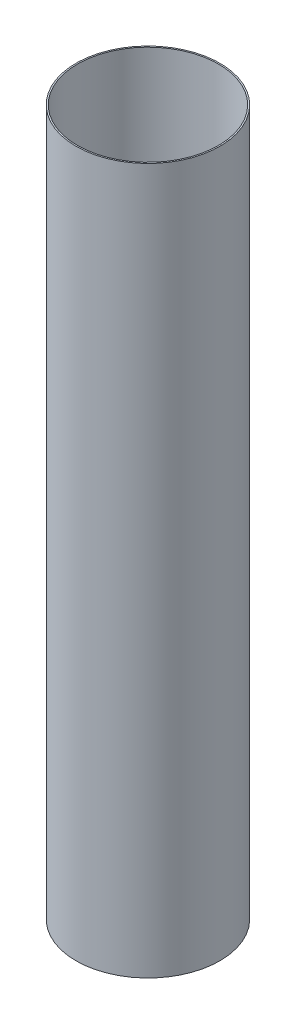
ISO-10303-21;
HEADER;
FILE_DESCRIPTION(('STEP AP214'),'2;1');
FILE_NAME('part.step','',(''),(''),'','','');
FILE_SCHEMA(('AUTOMOTIVE_DESIGN { 1 0 10303 214 1 1 1 1 }'));
ENDSEC;
DATA;
#1=APPLICATION_CONTEXT('core data for automotive mechanical design processes');
#2=APPLICATION_PROTOCOL_DEFINITION('international standard','automotive_design',2000,#1);
#3=PRODUCT_CONTEXT('',#1,'mechanical');
#4=PRODUCT('Part','Part','',(#3));
#5=PRODUCT_RELATED_PRODUCT_CATEGORY('part','',(#4));
#6=PRODUCT_DEFINITION_FORMATION('','',#4);
#7=PRODUCT_DEFINITION_CONTEXT('part definition',#1,'design');
#8=PRODUCT_DEFINITION('design','',#6,#7);
#9=PRODUCT_DEFINITION_SHAPE('','',#8);
#10=(LENGTH_UNIT() NAMED_UNIT(*) SI_UNIT(.MILLI.,.METRE.));
#11=(NAMED_UNIT(*) PLANE_ANGLE_UNIT() SI_UNIT($,.RADIAN.));
#12=(NAMED_UNIT(*) SI_UNIT($,.STERADIAN.) SOLID_ANGLE_UNIT());
#13=UNCERTAINTY_MEASURE_WITH_UNIT(LENGTH_MEASURE(1.E-05),#10,'distance_accuracy_value','');
#14=(GEOMETRIC_REPRESENTATION_CONTEXT(3) GLOBAL_UNCERTAINTY_ASSIGNED_CONTEXT((#13)) GLOBAL_UNIT_ASSIGNED_CONTEXT((#10,
#11,#12)) REPRESENTATION_CONTEXT('',''));
#15=CARTESIAN_POINT('',(0.,0.,0.));
#16=DIRECTION('',(0.,0.,1.));
#17=DIRECTION('',(1.,0.,0.));
#18=AXIS2_PLACEMENT_3D('',#15,#16,#17);
#19=CARTESIAN_POINT('',(0.,1500.,0.));
#20=DIRECTION('',(0.,1.,0.));
#21=DIRECTION('',(0.,0.,1.));
#22=AXIS2_PLACEMENT_3D('',#19,#20,#21);
#23=PLANE('',#22);
#24=CARTESIAN_POINT('',(0.,1500.,0.));
#25=DIRECTION('',(0.,1.,0.));
#26=DIRECTION('',(0.,0.,1.));
#27=AXIS2_PLACEMENT_3D('',#24,#25,#26);
#28=CIRCLE('',#27,153.);
#29=CARTESIAN_POINT('',(0.,1500.,153.));
#30=VERTEX_POINT('',#29);
#31=EDGE_CURVE('E10',#30,#30,#28,.T.);
#32=ORIENTED_EDGE('',*,*,#31,.T.);
#33=EDGE_LOOP('',(#32));
#34=FACE_BOUND('',#33,.T.);
#35=CARTESIAN_POINT('',(0.,1500.,0.));
#36=DIRECTION('',(0.,1.,0.));
#37=DIRECTION('',(0.,0.,1.));
#38=AXIS2_PLACEMENT_3D('',#35,#36,#37);
#39=CIRCLE('',#38,150.);
#40=CARTESIAN_POINT('',(0.,1500.,150.));
#41=VERTEX_POINT('',#40);
#42=EDGE_CURVE('E42',#41,#41,#39,.T.);
#43=ORIENTED_EDGE('',*,*,#42,.F.);
#44=EDGE_LOOP('',(#43));
#45=FACE_BOUND('',#44,.T.);
#46=ADVANCED_FACE('F31',(#34,#45),#23,.T.);
#47=CARTESIAN_POINT('',(0.,0.,0.));
#48=DIRECTION('',(0.,1.,0.));
#49=DIRECTION('',(0.,0.,1.));
#50=AXIS2_PLACEMENT_3D('',#47,#48,#49);
#51=PLANE('',#50);
#52=CARTESIAN_POINT('',(0.,0.,0.));
#53=DIRECTION('',(0.,1.,0.));
#54=DIRECTION('',(0.,0.,1.));
#55=AXIS2_PLACEMENT_3D('',#52,#53,#54);
#56=CIRCLE('',#55,153.);
#57=CARTESIAN_POINT('',(0.,0.,153.));
#58=VERTEX_POINT('',#57);
#59=EDGE_CURVE('E35',#58,#58,#56,.T.);
#60=ORIENTED_EDGE('',*,*,#59,.F.);
#61=EDGE_LOOP('',(#60));
#62=FACE_BOUND('',#61,.T.);
#63=CARTESIAN_POINT('',(0.,0.,0.));
#64=DIRECTION('',(0.,1.,0.));
#65=DIRECTION('',(0.,0.,1.));
#66=AXIS2_PLACEMENT_3D('',#63,#64,#65);
#67=CIRCLE('',#66,150.);
#68=CARTESIAN_POINT('',(0.,0.,150.));
#69=VERTEX_POINT('',#68);
#70=EDGE_CURVE('E44',#69,#69,#67,.T.);
#71=ORIENTED_EDGE('',*,*,#70,.T.);
#72=EDGE_LOOP('',(#71));
#73=FACE_BOUND('',#72,.T.);
#74=ADVANCED_FACE('F54',(#62,#73),#51,.F.);
#75=CARTESIAN_POINT('',(0.,1500.,0.));
#76=DIRECTION('',(0.,-1.,0.));
#77=DIRECTION('',(0.,0.,-1.));
#78=AXIS2_PLACEMENT_3D('',#75,#76,#77);
#79=CYLINDRICAL_SURFACE('',#78,153.);
#80=ORIENTED_EDGE('',*,*,#31,.F.);
#81=EDGE_LOOP('',(#80));
#82=FACE_BOUND('',#81,.T.);
#83=ORIENTED_EDGE('',*,*,#59,.T.);
#84=EDGE_LOOP('',(#83));
#85=FACE_BOUND('',#84,.T.);
#86=ADVANCED_FACE('F33',(#82,#85),#79,.T.);
#87=CARTESIAN_POINT('',(0.,1500.,0.));
#88=DIRECTION('',(0.,-1.,0.));
#89=DIRECTION('',(0.,0.,-1.));
#90=AXIS2_PLACEMENT_3D('',#87,#88,#89);
#91=CYLINDRICAL_SURFACE('',#90,150.);
#92=ORIENTED_EDGE('',*,*,#42,.T.);
#93=EDGE_LOOP('',(#92));
#94=FACE_BOUND('',#93,.T.);
#95=ORIENTED_EDGE('',*,*,#70,.F.);
#96=EDGE_LOOP('',(#95));
#97=FACE_BOUND('',#96,.T.);
#98=ADVANCED_FACE('F50',(#94,#97),#91,.F.);
#99=CLOSED_SHELL('',(#46,#74,#86,#98));
#100=MANIFOLD_SOLID_BREP('B2',#99);
#101=ADVANCED_BREP_SHAPE_REPRESENTATION('',(#18,#100),#14);
#102=SHAPE_DEFINITION_REPRESENTATION(#9,#101);
ENDSEC;
END-ISO-10303-21;
